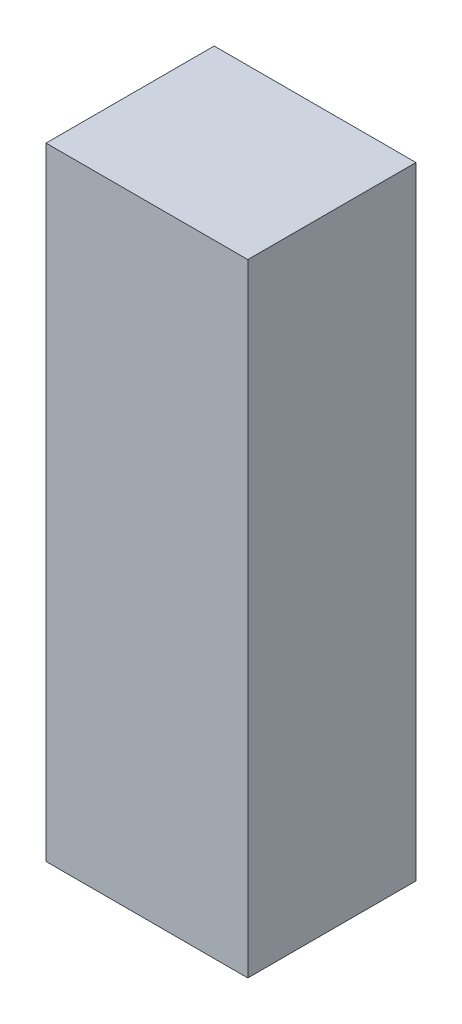
ISO-10303-21;
HEADER;
FILE_DESCRIPTION(('STEP AP214'),'2;1');
FILE_NAME('part.step','',(''),(''),'','','');
FILE_SCHEMA(('AUTOMOTIVE_DESIGN { 1 0 10303 214 1 1 1 1 }'));
ENDSEC;
DATA;
#1=APPLICATION_CONTEXT('core data for automotive mechanical design processes');
#2=APPLICATION_PROTOCOL_DEFINITION('international standard','automotive_design',2000,#1);
#3=PRODUCT_CONTEXT('',#1,'mechanical');
#4=PRODUCT('Part','Part','',(#3));
#5=PRODUCT_RELATED_PRODUCT_CATEGORY('part','',(#4));
#6=PRODUCT_DEFINITION_FORMATION('','',#4);
#7=PRODUCT_DEFINITION_CONTEXT('part definition',#1,'design');
#8=PRODUCT_DEFINITION('design','',#6,#7);
#9=PRODUCT_DEFINITION_SHAPE('','',#8);
#10=(LENGTH_UNIT() NAMED_UNIT(*) SI_UNIT(.MILLI.,.METRE.));
#11=(NAMED_UNIT(*) PLANE_ANGLE_UNIT() SI_UNIT($,.RADIAN.));
#12=(NAMED_UNIT(*) SI_UNIT($,.STERADIAN.) SOLID_ANGLE_UNIT());
#13=UNCERTAINTY_MEASURE_WITH_UNIT(LENGTH_MEASURE(1.E-05),#10,'distance_accuracy_value','');
#14=(GEOMETRIC_REPRESENTATION_CONTEXT(3) GLOBAL_UNCERTAINTY_ASSIGNED_CONTEXT((#13)) GLOBAL_UNIT_ASSIGNED_CONTEXT((#10,
#11,#12)) REPRESENTATION_CONTEXT('',''));
#15=CARTESIAN_POINT('',(0.,0.,0.));
#16=DIRECTION('',(0.,0.,1.));
#17=DIRECTION('',(1.,0.,0.));
#18=AXIS2_PLACEMENT_3D('',#15,#16,#17);
#19=CARTESIAN_POINT('',(-0.36,0.115,0.));
#20=DIRECTION('',(1.,0.,0.));
#21=DIRECTION('',(0.,0.,1.));
#22=AXIS2_PLACEMENT_3D('',#19,#20,#21);
#23=PLANE('',#22);
#24=DIRECTION('',(0.,1.,0.));
#25=VECTOR('',#24,1.);
#26=CARTESIAN_POINT('',(-0.36,0.115,0.1));
#27=LINE('',#26,#25);
#28=CARTESIAN_POINT('',(-0.36,0.115,0.1));
#29=VERTEX_POINT('',#28);
#30=CARTESIAN_POINT('',(-0.36,0.485,0.1));
#31=VERTEX_POINT('',#30);
#32=EDGE_CURVE('E11',#29,#31,#27,.T.);
#33=ORIENTED_EDGE('',*,*,#32,.T.);
#34=DIRECTION('',(0.,0.,1.));
#35=VECTOR('',#34,1.);
#36=CARTESIAN_POINT('',(-0.36,0.485,0.));
#37=LINE('',#36,#35);
#38=CARTESIAN_POINT('',(-0.36,0.485,0.));
#39=VERTEX_POINT('',#38);
#40=EDGE_CURVE('E24',#39,#31,#37,.T.);
#41=ORIENTED_EDGE('',*,*,#40,.F.);
#42=DIRECTION('',(0.,1.,0.));
#43=VECTOR('',#42,1.);
#44=CARTESIAN_POINT('',(-0.36,0.115,0.));
#45=LINE('',#44,#43);
#46=CARTESIAN_POINT('',(-0.36,0.115,0.));
#47=VERTEX_POINT('',#46);
#48=EDGE_CURVE('E86',#47,#39,#45,.T.);
#49=ORIENTED_EDGE('',*,*,#48,.F.);
#50=DIRECTION('',(0.,0.,1.));
#51=VECTOR('',#50,1.);
#52=CARTESIAN_POINT('',(-0.36,0.115,0.));
#53=LINE('',#52,#51);
#54=EDGE_CURVE('E36',#47,#29,#53,.T.);
#55=ORIENTED_EDGE('',*,*,#54,.T.);
#56=EDGE_LOOP('',(#33,#41,#49,#55));
#57=FACE_BOUND('',#56,.T.);
#58=ADVANCED_FACE('F17',(#57),#23,.F.);
#59=CARTESIAN_POINT('',(-0.24,0.115,0.));
#60=DIRECTION('',(1.,0.,0.));
#61=DIRECTION('',(0.,0.,1.));
#62=AXIS2_PLACEMENT_3D('',#59,#60,#61);
#63=PLANE('',#62);
#64=DIRECTION('',(0.,0.,1.));
#65=VECTOR('',#64,1.);
#66=CARTESIAN_POINT('',(-0.24,0.115,0.));
#67=LINE('',#66,#65);
#68=CARTESIAN_POINT('',(-0.24,0.115,0.));
#69=VERTEX_POINT('',#68);
#70=CARTESIAN_POINT('',(-0.24,0.115,0.1));
#71=VERTEX_POINT('',#70);
#72=EDGE_CURVE('E83',#69,#71,#67,.T.);
#73=ORIENTED_EDGE('',*,*,#72,.F.);
#74=DIRECTION('',(0.,1.,0.));
#75=VECTOR('',#74,1.);
#76=CARTESIAN_POINT('',(-0.24,0.115,0.));
#77=LINE('',#76,#75);
#78=CARTESIAN_POINT('',(-0.24,0.485,0.));
#79=VERTEX_POINT('',#78);
#80=EDGE_CURVE('E63',#69,#79,#77,.T.);
#81=ORIENTED_EDGE('',*,*,#80,.T.);
#82=DIRECTION('',(0.,0.,1.));
#83=VECTOR('',#82,1.);
#84=CARTESIAN_POINT('',(-0.24,0.485,0.));
#85=LINE('',#84,#83);
#86=CARTESIAN_POINT('',(-0.24,0.485,0.1));
#87=VERTEX_POINT('',#86);
#88=EDGE_CURVE('E57',#79,#87,#85,.T.);
#89=ORIENTED_EDGE('',*,*,#88,.T.);
#90=DIRECTION('',(0.,1.,0.));
#91=VECTOR('',#90,1.);
#92=CARTESIAN_POINT('',(-0.24,0.115,0.1));
#93=LINE('',#92,#91);
#94=EDGE_CURVE('E60',#71,#87,#93,.T.);
#95=ORIENTED_EDGE('',*,*,#94,.F.);
#96=EDGE_LOOP('',(#73,#81,#89,#95));
#97=FACE_BOUND('',#96,.T.);
#98=ADVANCED_FACE('F59',(#97),#63,.T.);
#99=CARTESIAN_POINT('',(-0.36,0.115,0.));
#100=DIRECTION('',(0.,1.,0.));
#101=DIRECTION('',(0.,0.,1.));
#102=AXIS2_PLACEMENT_3D('',#99,#100,#101);
#103=PLANE('',#102);
#104=ORIENTED_EDGE('',*,*,#72,.T.);
#105=DIRECTION('',(1.,0.,0.));
#106=VECTOR('',#105,1.);
#107=CARTESIAN_POINT('',(-0.36,0.115,0.1));
#108=LINE('',#107,#106);
#109=EDGE_CURVE('E71',#29,#71,#108,.T.);
#110=ORIENTED_EDGE('',*,*,#109,.F.);
#111=ORIENTED_EDGE('',*,*,#54,.F.);
#112=DIRECTION('',(1.,0.,0.));
#113=VECTOR('',#112,1.);
#114=CARTESIAN_POINT('',(-0.36,0.115,0.));
#115=LINE('',#114,#113);
#116=EDGE_CURVE('E76',#47,#69,#115,.T.);
#117=ORIENTED_EDGE('',*,*,#116,.T.);
#118=EDGE_LOOP('',(#104,#110,#111,#117));
#119=FACE_BOUND('',#118,.T.);
#120=ADVANCED_FACE('F91',(#119),#103,.F.);
#121=CARTESIAN_POINT('',(-0.36,0.485,0.));
#122=DIRECTION('',(0.,1.,0.));
#123=DIRECTION('',(0.,0.,1.));
#124=AXIS2_PLACEMENT_3D('',#121,#122,#123);
#125=PLANE('',#124);
#126=DIRECTION('',(1.,0.,0.));
#127=VECTOR('',#126,1.);
#128=CARTESIAN_POINT('',(-0.36,0.485,0.));
#129=LINE('',#128,#127);
#130=EDGE_CURVE('E74',#39,#79,#129,.T.);
#131=ORIENTED_EDGE('',*,*,#130,.F.);
#132=ORIENTED_EDGE('',*,*,#40,.T.);
#133=DIRECTION('',(1.,0.,0.));
#134=VECTOR('',#133,1.);
#135=CARTESIAN_POINT('',(-0.36,0.485,0.1));
#136=LINE('',#135,#134);
#137=EDGE_CURVE('E69',#31,#87,#136,.T.);
#138=ORIENTED_EDGE('',*,*,#137,.T.);
#139=ORIENTED_EDGE('',*,*,#88,.F.);
#140=EDGE_LOOP('',(#131,#132,#138,#139));
#141=FACE_BOUND('',#140,.T.);
#142=ADVANCED_FACE('F73',(#141),#125,.T.);
#143=CARTESIAN_POINT('',(-0.36,0.115,0.));
#144=DIRECTION('',(0.,0.,1.));
#145=DIRECTION('',(1.,0.,0.));
#146=AXIS2_PLACEMENT_3D('',#143,#144,#145);
#147=PLANE('',#146);
#148=ORIENTED_EDGE('',*,*,#130,.T.);
#149=ORIENTED_EDGE('',*,*,#80,.F.);
#150=ORIENTED_EDGE('',*,*,#116,.F.);
#151=ORIENTED_EDGE('',*,*,#48,.T.);
#152=EDGE_LOOP('',(#148,#149,#150,#151));
#153=FACE_BOUND('',#152,.T.);
#154=ADVANCED_FACE('F89',(#153),#147,.F.);
#155=CARTESIAN_POINT('',(-0.36,0.115,0.1));
#156=DIRECTION('',(0.,0.,1.));
#157=DIRECTION('',(1.,0.,0.));
#158=AXIS2_PLACEMENT_3D('',#155,#156,#157);
#159=PLANE('',#158);
#160=ORIENTED_EDGE('',*,*,#32,.F.);
#161=ORIENTED_EDGE('',*,*,#109,.T.);
#162=ORIENTED_EDGE('',*,*,#94,.T.);
#163=ORIENTED_EDGE('',*,*,#137,.F.);
#164=EDGE_LOOP('',(#160,#161,#162,#163));
#165=FACE_BOUND('',#164,.T.);
#166=ADVANCED_FACE('F68',(#165),#159,.T.);
#167=CLOSED_SHELL('',(#58,#98,#120,#142,#154,#166));
#168=MANIFOLD_SOLID_BREP('B1',#167);
#169=ADVANCED_BREP_SHAPE_REPRESENTATION('',(#18,#168),#14);
#170=SHAPE_DEFINITION_REPRESENTATION(#9,#169);
ENDSEC;
END-ISO-10303-21;
